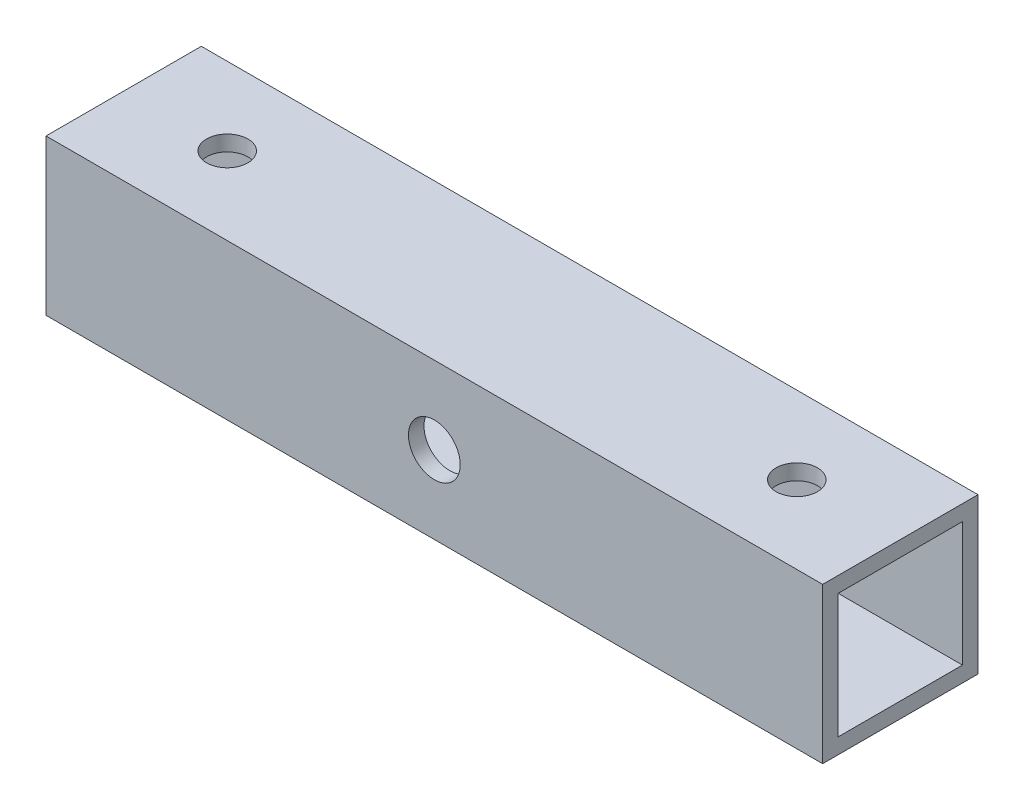
ISO-10303-21;
HEADER;
FILE_DESCRIPTION(('STEP AP214'),'2;1');
FILE_NAME('part.step','',(''),(''),'','','');
FILE_SCHEMA(('AUTOMOTIVE_DESIGN { 1 0 10303 214 1 1 1 1 }'));
ENDSEC;
DATA;
#1=APPLICATION_CONTEXT('core data for automotive mechanical design processes');
#2=APPLICATION_PROTOCOL_DEFINITION('international standard','automotive_design',2000,#1);
#3=PRODUCT_CONTEXT('',#1,'mechanical');
#4=PRODUCT('Part','Part','',(#3));
#5=PRODUCT_RELATED_PRODUCT_CATEGORY('part','',(#4));
#6=PRODUCT_DEFINITION_FORMATION('','',#4);
#7=PRODUCT_DEFINITION_CONTEXT('part definition',#1,'design');
#8=PRODUCT_DEFINITION('design','',#6,#7);
#9=PRODUCT_DEFINITION_SHAPE('','',#8);
#10=(LENGTH_UNIT() NAMED_UNIT(*) SI_UNIT(.MILLI.,.METRE.));
#11=(NAMED_UNIT(*) PLANE_ANGLE_UNIT() SI_UNIT($,.RADIAN.));
#12=(NAMED_UNIT(*) SI_UNIT($,.STERADIAN.) SOLID_ANGLE_UNIT());
#13=UNCERTAINTY_MEASURE_WITH_UNIT(LENGTH_MEASURE(1.E-05),#10,'distance_accuracy_value','');
#14=(GEOMETRIC_REPRESENTATION_CONTEXT(3) GLOBAL_UNCERTAINTY_ASSIGNED_CONTEXT((#13)) GLOBAL_UNIT_ASSIGNED_CONTEXT((#10,
#11,#12)) REPRESENTATION_CONTEXT('',''));
#15=CARTESIAN_POINT('',(0.,0.,0.));
#16=DIRECTION('',(0.,0.,1.));
#17=DIRECTION('',(1.,0.,0.));
#18=AXIS2_PLACEMENT_3D('',#15,#16,#17);
#19=CARTESIAN_POINT('',(75.,15.,30.));
#20=DIRECTION('',(-1.,0.,0.));
#21=DIRECTION('',(0.,0.,1.));
#22=AXIS2_PLACEMENT_3D('',#19,#20,#21);
#23=PLANE('',#22);
#24=DIRECTION('',(0.,1.,0.));
#25=VECTOR('',#24,1.);
#26=CARTESIAN_POINT('',(75.,15.,0.));
#27=LINE('',#26,#25);
#28=CARTESIAN_POINT('',(75.,-15.,0.));
#29=VERTEX_POINT('',#28);
#30=CARTESIAN_POINT('',(75.,15.,0.));
#31=VERTEX_POINT('',#30);
#32=EDGE_CURVE('E131',#29,#31,#27,.T.);
#33=ORIENTED_EDGE('',*,*,#32,.T.);
#34=DIRECTION('',(0.,0.,-1.));
#35=VECTOR('',#34,1.);
#36=CARTESIAN_POINT('',(75.,15.,30.));
#37=LINE('',#36,#35);
#38=CARTESIAN_POINT('',(75.,15.,30.));
#39=VERTEX_POINT('',#38);
#40=EDGE_CURVE('E11',#39,#31,#37,.T.);
#41=ORIENTED_EDGE('',*,*,#40,.F.);
#42=DIRECTION('',(0.,1.,0.));
#43=VECTOR('',#42,1.);
#44=CARTESIAN_POINT('',(75.,15.,30.));
#45=LINE('',#44,#43);
#46=CARTESIAN_POINT('',(75.,-15.,30.));
#47=VERTEX_POINT('',#46);
#48=EDGE_CURVE('E137',#47,#39,#45,.T.);
#49=ORIENTED_EDGE('',*,*,#48,.F.);
#50=DIRECTION('',(0.,0.,-1.));
#51=VECTOR('',#50,1.);
#52=CARTESIAN_POINT('',(75.,-15.,30.));
#53=LINE('',#52,#51);
#54=EDGE_CURVE('E147',#47,#29,#53,.T.);
#55=ORIENTED_EDGE('',*,*,#54,.T.);
#56=EDGE_LOOP('',(#33,#41,#49,#55));
#57=FACE_BOUND('',#56,.T.);
#58=DIRECTION('',(0.,1.,0.));
#59=VECTOR('',#58,1.);
#60=CARTESIAN_POINT('',(75.,15.,3.));
#61=LINE('',#60,#59);
#62=CARTESIAN_POINT('',(75.,-12.,3.));
#63=VERTEX_POINT('',#62);
#64=CARTESIAN_POINT('',(75.,12.,3.));
#65=VERTEX_POINT('',#64);
#66=EDGE_CURVE('E107',#63,#65,#61,.T.);
#67=ORIENTED_EDGE('',*,*,#66,.F.);
#68=DIRECTION('',(0.,0.,-1.));
#69=VECTOR('',#68,1.);
#70=CARTESIAN_POINT('',(75.,-12.,30.));
#71=LINE('',#70,#69);
#72=CARTESIAN_POINT('',(75.,-12.,27.));
#73=VERTEX_POINT('',#72);
#74=EDGE_CURVE('E127',#73,#63,#71,.T.);
#75=ORIENTED_EDGE('',*,*,#74,.F.);
#76=DIRECTION('',(0.,1.,0.));
#77=VECTOR('',#76,1.);
#78=CARTESIAN_POINT('',(75.,15.,27.));
#79=LINE('',#78,#77);
#80=CARTESIAN_POINT('',(75.,12.,27.));
#81=VERTEX_POINT('',#80);
#82=EDGE_CURVE('E51',#73,#81,#79,.T.);
#83=ORIENTED_EDGE('',*,*,#82,.T.);
#84=DIRECTION('',(0.,0.,-1.));
#85=VECTOR('',#84,1.);
#86=CARTESIAN_POINT('',(75.,12.,30.));
#87=LINE('',#86,#85);
#88=EDGE_CURVE('E117',#81,#65,#87,.T.);
#89=ORIENTED_EDGE('',*,*,#88,.T.);
#90=EDGE_LOOP('',(#67,#75,#83,#89));
#91=FACE_BOUND('',#90,.T.);
#92=ADVANCED_FACE('F35',(#57,#91),#23,.F.);
#93=CARTESIAN_POINT('',(-75.,15.,30.));
#94=DIRECTION('',(1.,0.,0.));
#95=DIRECTION('',(0.,0.,-1.));
#96=AXIS2_PLACEMENT_3D('',#93,#94,#95);
#97=PLANE('',#96);
#98=DIRECTION('',(0.,-1.,0.));
#99=VECTOR('',#98,1.);
#100=CARTESIAN_POINT('',(-75.,15.,0.));
#101=LINE('',#100,#99);
#102=CARTESIAN_POINT('',(-75.,15.,0.));
#103=VERTEX_POINT('',#102);
#104=CARTESIAN_POINT('',(-75.,-15.,0.));
#105=VERTEX_POINT('',#104);
#106=EDGE_CURVE('E152',#103,#105,#101,.T.);
#107=ORIENTED_EDGE('',*,*,#106,.T.);
#108=DIRECTION('',(0.,0.,-1.));
#109=VECTOR('',#108,1.);
#110=CARTESIAN_POINT('',(-75.,-15.,30.));
#111=LINE('',#110,#109);
#112=CARTESIAN_POINT('',(-75.,-15.,30.));
#113=VERTEX_POINT('',#112);
#114=EDGE_CURVE('E157',#113,#105,#111,.T.);
#115=ORIENTED_EDGE('',*,*,#114,.F.);
#116=DIRECTION('',(0.,-1.,0.));
#117=VECTOR('',#116,1.);
#118=CARTESIAN_POINT('',(-75.,15.,30.));
#119=LINE('',#118,#117);
#120=CARTESIAN_POINT('',(-75.,15.,30.));
#121=VERTEX_POINT('',#120);
#122=EDGE_CURVE('E143',#121,#113,#119,.T.);
#123=ORIENTED_EDGE('',*,*,#122,.F.);
#124=DIRECTION('',(0.,0.,-1.));
#125=VECTOR('',#124,1.);
#126=CARTESIAN_POINT('',(-75.,15.,30.));
#127=LINE('',#126,#125);
#128=EDGE_CURVE('E43',#121,#103,#127,.T.);
#129=ORIENTED_EDGE('',*,*,#128,.T.);
#130=EDGE_LOOP('',(#107,#115,#123,#129));
#131=FACE_BOUND('',#130,.T.);
#132=DIRECTION('',(0.,-1.,0.));
#133=VECTOR('',#132,1.);
#134=CARTESIAN_POINT('',(-75.,15.,3.));
#135=LINE('',#134,#133);
#136=CARTESIAN_POINT('',(-75.,12.,3.));
#137=VERTEX_POINT('',#136);
#138=CARTESIAN_POINT('',(-75.,-12.,3.));
#139=VERTEX_POINT('',#138);
#140=EDGE_CURVE('E104',#137,#139,#135,.T.);
#141=ORIENTED_EDGE('',*,*,#140,.F.);
#142=DIRECTION('',(0.,0.,-1.));
#143=VECTOR('',#142,1.);
#144=CARTESIAN_POINT('',(-75.,12.,30.));
#145=LINE('',#144,#143);
#146=CARTESIAN_POINT('',(-75.,12.,27.));
#147=VERTEX_POINT('',#146);
#148=EDGE_CURVE('E113',#147,#137,#145,.T.);
#149=ORIENTED_EDGE('',*,*,#148,.F.);
#150=DIRECTION('',(0.,-1.,0.));
#151=VECTOR('',#150,1.);
#152=CARTESIAN_POINT('',(-75.,15.,27.));
#153=LINE('',#152,#151);
#154=CARTESIAN_POINT('',(-75.,-12.,27.));
#155=VERTEX_POINT('',#154);
#156=EDGE_CURVE('E56',#147,#155,#153,.T.);
#157=ORIENTED_EDGE('',*,*,#156,.T.);
#158=DIRECTION('',(0.,0.,-1.));
#159=VECTOR('',#158,1.);
#160=CARTESIAN_POINT('',(-75.,-12.,30.));
#161=LINE('',#160,#159);
#162=EDGE_CURVE('E118',#155,#139,#161,.T.);
#163=ORIENTED_EDGE('',*,*,#162,.T.);
#164=EDGE_LOOP('',(#141,#149,#157,#163));
#165=FACE_BOUND('',#164,.T.);
#166=ADVANCED_FACE('F121',(#131,#165),#97,.F.);
#167=CARTESIAN_POINT('',(-75.,15.,30.));
#168=DIRECTION('',(0.,-1.,0.));
#169=DIRECTION('',(0.,0.,-1.));
#170=AXIS2_PLACEMENT_3D('',#167,#168,#169);
#171=PLANE('',#170);
#172=CARTESIAN_POINT('',(-55.,15.,15.));
#173=DIRECTION('',(0.,1.,0.));
#174=DIRECTION('',(0.,0.,1.));
#175=AXIS2_PLACEMENT_3D('',#172,#173,#174);
#176=CIRCLE('',#175,4.00000000000001);
#177=CARTESIAN_POINT('',(-55.,15.,19.));
#178=VERTEX_POINT('',#177);
#179=EDGE_CURVE('E168',#178,#178,#176,.T.);
#180=ORIENTED_EDGE('',*,*,#179,.F.);
#181=EDGE_LOOP('',(#180));
#182=FACE_BOUND('',#181,.T.);
#183=CARTESIAN_POINT('',(55.,15.,15.));
#184=DIRECTION('',(0.,1.,0.));
#185=DIRECTION('',(0.,0.,1.));
#186=AXIS2_PLACEMENT_3D('',#183,#184,#185);
#187=CIRCLE('',#186,4.00000000000001);
#188=CARTESIAN_POINT('',(55.,15.,19.));
#189=VERTEX_POINT('',#188);
#190=EDGE_CURVE('E175',#189,#189,#187,.T.);
#191=ORIENTED_EDGE('',*,*,#190,.F.);
#192=EDGE_LOOP('',(#191));
#193=FACE_BOUND('',#192,.T.);
#194=DIRECTION('',(-1.,0.,0.));
#195=VECTOR('',#194,1.);
#196=CARTESIAN_POINT('',(-75.,15.,0.));
#197=LINE('',#196,#195);
#198=EDGE_CURVE('E150',#31,#103,#197,.T.);
#199=ORIENTED_EDGE('',*,*,#198,.T.);
#200=ORIENTED_EDGE('',*,*,#128,.F.);
#201=DIRECTION('',(-1.,0.,0.));
#202=VECTOR('',#201,1.);
#203=CARTESIAN_POINT('',(-75.,15.,30.));
#204=LINE('',#203,#202);
#205=EDGE_CURVE('E140',#39,#121,#204,.T.);
#206=ORIENTED_EDGE('',*,*,#205,.F.);
#207=ORIENTED_EDGE('',*,*,#40,.T.);
#208=EDGE_LOOP('',(#199,#200,#206,#207));
#209=FACE_BOUND('',#208,.T.);
#210=ADVANCED_FACE('F207',(#182,#193,#209),#171,.F.);
#211=CARTESIAN_POINT('',(-75.,-15.,30.));
#212=DIRECTION('',(0.,1.,0.));
#213=DIRECTION('',(0.,0.,1.));
#214=AXIS2_PLACEMENT_3D('',#211,#212,#213);
#215=PLANE('',#214);
#216=CARTESIAN_POINT('',(-55.,-15.,15.));
#217=DIRECTION('',(0.,1.,0.));
#218=DIRECTION('',(0.,0.,1.));
#219=AXIS2_PLACEMENT_3D('',#216,#217,#218);
#220=CIRCLE('',#219,4.00000000000001);
#221=CARTESIAN_POINT('',(-55.,-15.,19.));
#222=VERTEX_POINT('',#221);
#223=EDGE_CURVE('E187',#222,#222,#220,.T.);
#224=ORIENTED_EDGE('',*,*,#223,.T.);
#225=EDGE_LOOP('',(#224));
#226=FACE_BOUND('',#225,.T.);
#227=CARTESIAN_POINT('',(55.,-15.,15.));
#228=DIRECTION('',(0.,1.,0.));
#229=DIRECTION('',(0.,0.,1.));
#230=AXIS2_PLACEMENT_3D('',#227,#228,#229);
#231=CIRCLE('',#230,4.00000000000001);
#232=CARTESIAN_POINT('',(55.,-15.,19.));
#233=VERTEX_POINT('',#232);
#234=EDGE_CURVE('E172',#233,#233,#231,.T.);
#235=ORIENTED_EDGE('',*,*,#234,.T.);
#236=EDGE_LOOP('',(#235));
#237=FACE_BOUND('',#236,.T.);
#238=DIRECTION('',(1.,0.,0.));
#239=VECTOR('',#238,1.);
#240=CARTESIAN_POINT('',(-75.,-15.,0.));
#241=LINE('',#240,#239);
#242=EDGE_CURVE('E141',#105,#29,#241,.T.);
#243=ORIENTED_EDGE('',*,*,#242,.T.);
#244=ORIENTED_EDGE('',*,*,#54,.F.);
#245=DIRECTION('',(1.,0.,0.));
#246=VECTOR('',#245,1.);
#247=CARTESIAN_POINT('',(-75.,-15.,30.));
#248=LINE('',#247,#246);
#249=EDGE_CURVE('E145',#113,#47,#248,.T.);
#250=ORIENTED_EDGE('',*,*,#249,.F.);
#251=ORIENTED_EDGE('',*,*,#114,.T.);
#252=EDGE_LOOP('',(#243,#244,#250,#251));
#253=FACE_BOUND('',#252,.T.);
#254=ADVANCED_FACE('F226',(#226,#237,#253),#215,.F.);
#255=CARTESIAN_POINT('',(0.,0.,30.));
#256=DIRECTION('',(0.,0.,1.));
#257=DIRECTION('',(1.,0.,0.));
#258=AXIS2_PLACEMENT_3D('',#255,#256,#257);
#259=PLANE('',#258);
#260=CARTESIAN_POINT('',(0.,0.,30.));
#261=DIRECTION('',(0.,0.,1.));
#262=DIRECTION('',(1.,0.,0.));
#263=AXIS2_PLACEMENT_3D('',#260,#261,#262);
#264=CIRCLE('',#263,5.);
#265=CARTESIAN_POINT('',(5.,0.,30.));
#266=VERTEX_POINT('',#265);
#267=EDGE_CURVE('E190',#266,#266,#264,.T.);
#268=ORIENTED_EDGE('',*,*,#267,.F.);
#269=EDGE_LOOP('',(#268));
#270=FACE_BOUND('',#269,.T.);
#271=ORIENTED_EDGE('',*,*,#48,.T.);
#272=ORIENTED_EDGE('',*,*,#205,.T.);
#273=ORIENTED_EDGE('',*,*,#122,.T.);
#274=ORIENTED_EDGE('',*,*,#249,.T.);
#275=EDGE_LOOP('',(#271,#272,#273,#274));
#276=FACE_BOUND('',#275,.T.);
#277=ADVANCED_FACE('F222',(#270,#276),#259,.T.);
#278=CARTESIAN_POINT('',(0.,0.,0.));
#279=DIRECTION('',(0.,0.,1.));
#280=DIRECTION('',(1.,0.,0.));
#281=AXIS2_PLACEMENT_3D('',#278,#279,#280);
#282=PLANE('',#281);
#283=CARTESIAN_POINT('',(0.,0.,0.));
#284=DIRECTION('',(0.,0.,1.));
#285=DIRECTION('',(1.,0.,0.));
#286=AXIS2_PLACEMENT_3D('',#283,#284,#285);
#287=CIRCLE('',#286,5.);
#288=CARTESIAN_POINT('',(5.,0.,0.));
#289=VERTEX_POINT('',#288);
#290=EDGE_CURVE('E164',#289,#289,#287,.T.);
#291=ORIENTED_EDGE('',*,*,#290,.T.);
#292=EDGE_LOOP('',(#291));
#293=FACE_BOUND('',#292,.T.);
#294=ORIENTED_EDGE('',*,*,#32,.F.);
#295=ORIENTED_EDGE('',*,*,#242,.F.);
#296=ORIENTED_EDGE('',*,*,#106,.F.);
#297=ORIENTED_EDGE('',*,*,#198,.F.);
#298=EDGE_LOOP('',(#294,#295,#296,#297));
#299=FACE_BOUND('',#298,.T.);
#300=ADVANCED_FACE('F216',(#293,#299),#282,.F.);
#301=CARTESIAN_POINT('',(-75.,12.,30.));
#302=DIRECTION('',(0.,-1.,0.));
#303=DIRECTION('',(0.,0.,-1.));
#304=AXIS2_PLACEMENT_3D('',#301,#302,#303);
#305=PLANE('',#304);
#306=CARTESIAN_POINT('',(-55.,12.,15.));
#307=DIRECTION('',(0.,-1.,0.));
#308=DIRECTION('',(0.,0.,-1.));
#309=AXIS2_PLACEMENT_3D('',#306,#307,#308);
#310=CIRCLE('',#309,4.00000000000001);
#311=CARTESIAN_POINT('',(-55.,12.,11.));
#312=VERTEX_POINT('',#311);
#313=EDGE_CURVE('E184',#312,#312,#310,.T.);
#314=ORIENTED_EDGE('',*,*,#313,.F.);
#315=EDGE_LOOP('',(#314));
#316=FACE_BOUND('',#315,.T.);
#317=CARTESIAN_POINT('',(55.,12.,15.));
#318=DIRECTION('',(0.,-1.,0.));
#319=DIRECTION('',(0.,0.,-1.));
#320=AXIS2_PLACEMENT_3D('',#317,#318,#319);
#321=CIRCLE('',#320,4.00000000000001);
#322=CARTESIAN_POINT('',(55.,12.,11.));
#323=VERTEX_POINT('',#322);
#324=EDGE_CURVE('E167',#323,#323,#321,.T.);
#325=ORIENTED_EDGE('',*,*,#324,.F.);
#326=EDGE_LOOP('',(#325));
#327=FACE_BOUND('',#326,.T.);
#328=DIRECTION('',(-1.,0.,0.));
#329=VECTOR('',#328,1.);
#330=CARTESIAN_POINT('',(-75.,12.,3.));
#331=LINE('',#330,#329);
#332=EDGE_CURVE('E100',#65,#137,#331,.T.);
#333=ORIENTED_EDGE('',*,*,#332,.F.);
#334=ORIENTED_EDGE('',*,*,#88,.F.);
#335=DIRECTION('',(-1.,0.,0.));
#336=VECTOR('',#335,1.);
#337=CARTESIAN_POINT('',(-75.,12.,27.));
#338=LINE('',#337,#336);
#339=EDGE_CURVE('E115',#81,#147,#338,.T.);
#340=ORIENTED_EDGE('',*,*,#339,.T.);
#341=ORIENTED_EDGE('',*,*,#148,.T.);
#342=EDGE_LOOP('',(#333,#334,#340,#341));
#343=FACE_BOUND('',#342,.T.);
#344=ADVANCED_FACE('F114',(#316,#327,#343),#305,.T.);
#345=CARTESIAN_POINT('',(-75.,-12.,30.));
#346=DIRECTION('',(0.,1.,0.));
#347=DIRECTION('',(0.,0.,1.));
#348=AXIS2_PLACEMENT_3D('',#345,#346,#347);
#349=PLANE('',#348);
#350=CARTESIAN_POINT('',(-55.,-12.,15.));
#351=DIRECTION('',(0.,1.,0.));
#352=DIRECTION('',(0.,0.,1.));
#353=AXIS2_PLACEMENT_3D('',#350,#351,#352);
#354=CIRCLE('',#353,4.00000000000001);
#355=CARTESIAN_POINT('',(-55.,-12.,19.));
#356=VERTEX_POINT('',#355);
#357=EDGE_CURVE('E38',#356,#356,#354,.T.);
#358=ORIENTED_EDGE('',*,*,#357,.F.);
#359=EDGE_LOOP('',(#358));
#360=FACE_BOUND('',#359,.T.);
#361=CARTESIAN_POINT('',(55.,-12.,15.));
#362=DIRECTION('',(0.,1.,0.));
#363=DIRECTION('',(0.,0.,1.));
#364=AXIS2_PLACEMENT_3D('',#361,#362,#363);
#365=CIRCLE('',#364,4.00000000000001);
#366=CARTESIAN_POINT('',(55.,-12.,19.));
#367=VERTEX_POINT('',#366);
#368=EDGE_CURVE('E165',#367,#367,#365,.T.);
#369=ORIENTED_EDGE('',*,*,#368,.F.);
#370=EDGE_LOOP('',(#369));
#371=FACE_BOUND('',#370,.T.);
#372=DIRECTION('',(1.,0.,0.));
#373=VECTOR('',#372,1.);
#374=CARTESIAN_POINT('',(-75.,-12.,3.));
#375=LINE('',#374,#373);
#376=EDGE_CURVE('E122',#139,#63,#375,.T.);
#377=ORIENTED_EDGE('',*,*,#376,.F.);
#378=ORIENTED_EDGE('',*,*,#162,.F.);
#379=DIRECTION('',(1.,0.,0.));
#380=VECTOR('',#379,1.);
#381=CARTESIAN_POINT('',(-75.,-12.,27.));
#382=LINE('',#381,#380);
#383=EDGE_CURVE('E129',#155,#73,#382,.T.);
#384=ORIENTED_EDGE('',*,*,#383,.T.);
#385=ORIENTED_EDGE('',*,*,#74,.T.);
#386=EDGE_LOOP('',(#377,#378,#384,#385));
#387=FACE_BOUND('',#386,.T.);
#388=ADVANCED_FACE('F200',(#360,#371,#387),#349,.T.);
#389=CARTESIAN_POINT('',(0.,0.,27.));
#390=DIRECTION('',(0.,0.,1.));
#391=DIRECTION('',(1.,0.,0.));
#392=AXIS2_PLACEMENT_3D('',#389,#390,#391);
#393=PLANE('',#392);
#394=CARTESIAN_POINT('',(0.,0.,27.));
#395=DIRECTION('',(0.,0.,1.));
#396=DIRECTION('',(1.,0.,0.));
#397=AXIS2_PLACEMENT_3D('',#394,#395,#396);
#398=CIRCLE('',#397,5.);
#399=CARTESIAN_POINT('',(5.,0.,27.));
#400=VERTEX_POINT('',#399);
#401=EDGE_CURVE('E136',#400,#400,#398,.T.);
#402=ORIENTED_EDGE('',*,*,#401,.T.);
#403=EDGE_LOOP('',(#402));
#404=FACE_BOUND('',#403,.T.);
#405=ORIENTED_EDGE('',*,*,#82,.F.);
#406=ORIENTED_EDGE('',*,*,#383,.F.);
#407=ORIENTED_EDGE('',*,*,#156,.F.);
#408=ORIENTED_EDGE('',*,*,#339,.F.);
#409=EDGE_LOOP('',(#405,#406,#407,#408));
#410=FACE_BOUND('',#409,.T.);
#411=ADVANCED_FACE('F245',(#404,#410),#393,.F.);
#412=CARTESIAN_POINT('',(0.,0.,3.));
#413=DIRECTION('',(0.,0.,1.));
#414=DIRECTION('',(1.,0.,0.));
#415=AXIS2_PLACEMENT_3D('',#412,#413,#414);
#416=PLANE('',#415);
#417=CARTESIAN_POINT('',(0.,0.,3.));
#418=DIRECTION('',(0.,0.,1.));
#419=DIRECTION('',(1.,0.,0.));
#420=AXIS2_PLACEMENT_3D('',#417,#418,#419);
#421=CIRCLE('',#420,5.);
#422=CARTESIAN_POINT('',(5.,0.,3.));
#423=VERTEX_POINT('',#422);
#424=EDGE_CURVE('E162',#423,#423,#421,.T.);
#425=ORIENTED_EDGE('',*,*,#424,.F.);
#426=EDGE_LOOP('',(#425));
#427=FACE_BOUND('',#426,.T.);
#428=ORIENTED_EDGE('',*,*,#66,.T.);
#429=ORIENTED_EDGE('',*,*,#332,.T.);
#430=ORIENTED_EDGE('',*,*,#140,.T.);
#431=ORIENTED_EDGE('',*,*,#376,.T.);
#432=EDGE_LOOP('',(#428,#429,#430,#431));
#433=FACE_BOUND('',#432,.T.);
#434=ADVANCED_FACE('F102',(#427,#433),#416,.T.);
#435=CARTESIAN_POINT('',(0.,0.,0.));
#436=DIRECTION('',(0.,0.,1.));
#437=DIRECTION('',(1.,0.,0.));
#438=AXIS2_PLACEMENT_3D('',#435,#436,#437);
#439=CYLINDRICAL_SURFACE('',#438,5.);
#440=ORIENTED_EDGE('',*,*,#424,.T.);
#441=EDGE_LOOP('',(#440));
#442=FACE_BOUND('',#441,.T.);
#443=ORIENTED_EDGE('',*,*,#290,.F.);
#444=EDGE_LOOP('',(#443));
#445=FACE_BOUND('',#444,.T.);
#446=ADVANCED_FACE('F244',(#442,#445),#439,.F.);
#447=ORIENTED_EDGE('',*,*,#267,.T.);
#448=EDGE_LOOP('',(#447));
#449=FACE_BOUND('',#448,.T.);
#450=ORIENTED_EDGE('',*,*,#401,.F.);
#451=EDGE_LOOP('',(#450));
#452=FACE_BOUND('',#451,.T.);
#453=ADVANCED_FACE('F258',(#449,#452),#439,.F.);
#454=CARTESIAN_POINT('',(55.,-21.,15.));
#455=DIRECTION('',(0.,1.,0.));
#456=DIRECTION('',(0.,0.,1.));
#457=AXIS2_PLACEMENT_3D('',#454,#455,#456);
#458=CYLINDRICAL_SURFACE('',#457,4.00000000000001);
#459=ORIENTED_EDGE('',*,*,#368,.T.);
#460=EDGE_LOOP('',(#459));
#461=FACE_BOUND('',#460,.T.);
#462=ORIENTED_EDGE('',*,*,#234,.F.);
#463=EDGE_LOOP('',(#462));
#464=FACE_BOUND('',#463,.T.);
#465=ADVANCED_FACE('F260',(#461,#464),#458,.F.);
#466=CARTESIAN_POINT('',(-55.,-21.,15.));
#467=DIRECTION('',(0.,1.,0.));
#468=DIRECTION('',(0.,0.,1.));
#469=AXIS2_PLACEMENT_3D('',#466,#467,#468);
#470=CYLINDRICAL_SURFACE('',#469,4.00000000000001);
#471=ORIENTED_EDGE('',*,*,#357,.T.);
#472=EDGE_LOOP('',(#471));
#473=FACE_BOUND('',#472,.T.);
#474=ORIENTED_EDGE('',*,*,#223,.F.);
#475=EDGE_LOOP('',(#474));
#476=FACE_BOUND('',#475,.T.);
#477=ADVANCED_FACE('F263',(#473,#476),#470,.F.);
#478=ORIENTED_EDGE('',*,*,#324,.T.);
#479=EDGE_LOOP('',(#478));
#480=FACE_BOUND('',#479,.T.);
#481=ORIENTED_EDGE('',*,*,#190,.T.);
#482=EDGE_LOOP('',(#481));
#483=FACE_BOUND('',#482,.T.);
#484=ADVANCED_FACE('F264',(#480,#483),#458,.F.);
#485=ORIENTED_EDGE('',*,*,#313,.T.);
#486=EDGE_LOOP('',(#485));
#487=FACE_BOUND('',#486,.T.);
#488=ORIENTED_EDGE('',*,*,#179,.T.);
#489=EDGE_LOOP('',(#488));
#490=FACE_BOUND('',#489,.T.);
#491=ADVANCED_FACE('F267',(#487,#490),#470,.F.);
#492=CLOSED_SHELL('',(#92,#166,#210,#254,#277,#300,#344,#388,#411,#434,#446,#453,#465,#477,#484,#491));
#493=MANIFOLD_SOLID_BREP('B2',#492);
#494=ADVANCED_BREP_SHAPE_REPRESENTATION('',(#18,#493),#14);
#495=SHAPE_DEFINITION_REPRESENTATION(#9,#494);
ENDSEC;
END-ISO-10303-21;
